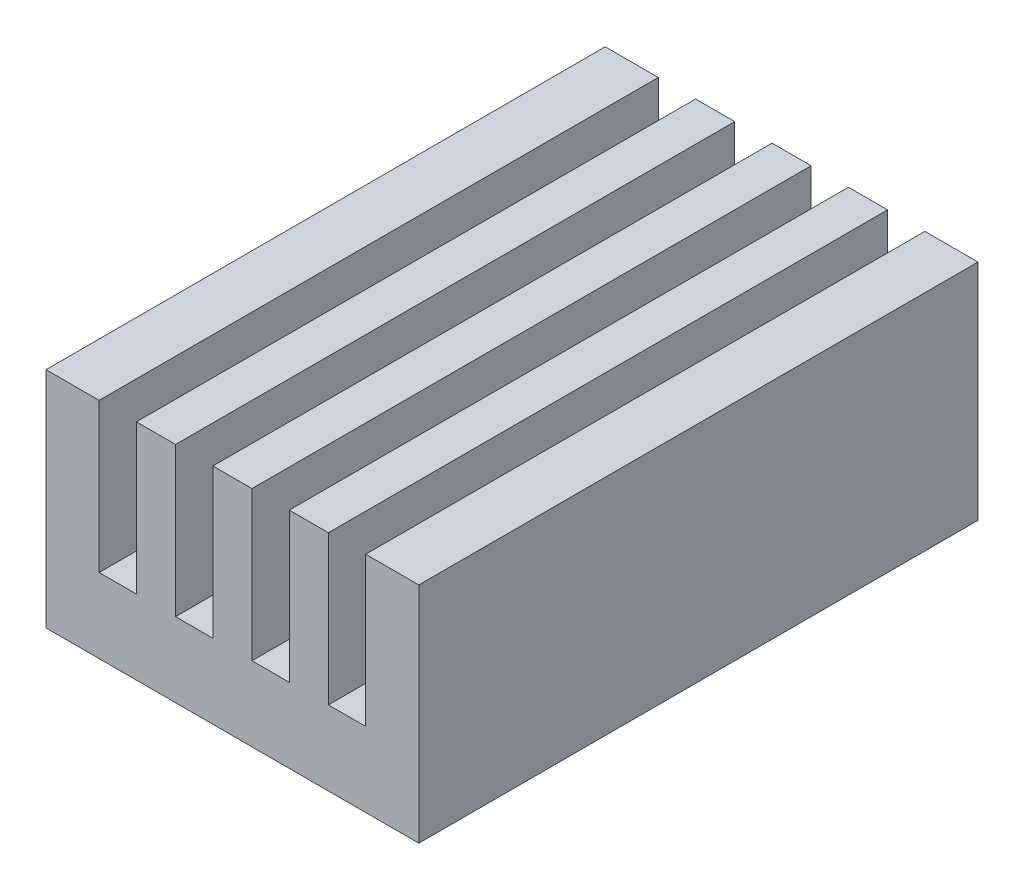
ISO-10303-21;
HEADER;
FILE_DESCRIPTION(('STEP AP214'),'2;1');
FILE_NAME('part.step','',(''),(''),'','','');
FILE_SCHEMA(('AUTOMOTIVE_DESIGN { 1 0 10303 214 1 1 1 1 }'));
ENDSEC;
DATA;
#1=APPLICATION_CONTEXT('core data for automotive mechanical design processes');
#2=APPLICATION_PROTOCOL_DEFINITION('international standard','automotive_design',2000,#1);
#3=PRODUCT_CONTEXT('',#1,'mechanical');
#4=PRODUCT('Part','Part','',(#3));
#5=PRODUCT_RELATED_PRODUCT_CATEGORY('part','',(#4));
#6=PRODUCT_DEFINITION_FORMATION('','',#4);
#7=PRODUCT_DEFINITION_CONTEXT('part definition',#1,'design');
#8=PRODUCT_DEFINITION('design','',#6,#7);
#9=PRODUCT_DEFINITION_SHAPE('','',#8);
#10=(LENGTH_UNIT() NAMED_UNIT(*) SI_UNIT(.MILLI.,.METRE.));
#11=(NAMED_UNIT(*) PLANE_ANGLE_UNIT() SI_UNIT($,.RADIAN.));
#12=(NAMED_UNIT(*) SI_UNIT($,.STERADIAN.) SOLID_ANGLE_UNIT());
#13=UNCERTAINTY_MEASURE_WITH_UNIT(LENGTH_MEASURE(1.E-05),#10,'distance_accuracy_value','');
#14=(GEOMETRIC_REPRESENTATION_CONTEXT(3) GLOBAL_UNCERTAINTY_ASSIGNED_CONTEXT((#13)) GLOBAL_UNIT_ASSIGNED_CONTEXT((#10,
#11,#12)) REPRESENTATION_CONTEXT('',''));
#15=CARTESIAN_POINT('',(0.,0.,0.));
#16=DIRECTION('',(0.,0.,1.));
#17=DIRECTION('',(1.,0.,0.));
#18=AXIS2_PLACEMENT_3D('',#15,#16,#17);
#19=CARTESIAN_POINT('',(-3.575,0.,15.));
#20=DIRECTION('',(1.,0.,0.));
#21=DIRECTION('',(0.,0.,-1.));
#22=AXIS2_PLACEMENT_3D('',#19,#20,#21);
#23=PLANE('',#22);
#24=DIRECTION('',(0.,-1.,0.));
#25=VECTOR('',#24,1.);
#26=CARTESIAN_POINT('',(-3.575,0.,0.));
#27=LINE('',#26,#25);
#28=CARTESIAN_POINT('',(-3.575,6.,0.));
#29=VERTEX_POINT('',#28);
#30=CARTESIAN_POINT('',(-3.575,2.,0.));
#31=VERTEX_POINT('',#30);
#32=EDGE_CURVE('E247',#29,#31,#27,.T.);
#33=ORIENTED_EDGE('',*,*,#32,.F.);
#34=DIRECTION('',(0.,0.,-1.));
#35=VECTOR('',#34,1.);
#36=CARTESIAN_POINT('',(-3.575,6.,15.));
#37=LINE('',#36,#35);
#38=CARTESIAN_POINT('',(-3.575,6.,15.));
#39=VERTEX_POINT('',#38);
#40=EDGE_CURVE('E11',#39,#29,#37,.T.);
#41=ORIENTED_EDGE('',*,*,#40,.F.);
#42=DIRECTION('',(0.,-1.,0.));
#43=VECTOR('',#42,1.);
#44=CARTESIAN_POINT('',(-3.575,0.,15.));
#45=LINE('',#44,#43);
#46=CARTESIAN_POINT('',(-3.575,2.,15.));
#47=VERTEX_POINT('',#46);
#48=EDGE_CURVE('E209',#39,#47,#45,.T.);
#49=ORIENTED_EDGE('',*,*,#48,.T.);
#50=DIRECTION('',(0.,0.,-1.));
#51=VECTOR('',#50,1.);
#52=CARTESIAN_POINT('',(-3.575,2.,15.));
#53=LINE('',#52,#51);
#54=EDGE_CURVE('E123',#47,#31,#53,.T.);
#55=ORIENTED_EDGE('',*,*,#54,.T.);
#56=EDGE_LOOP('',(#33,#41,#49,#55));
#57=FACE_BOUND('',#56,.T.);
#58=ADVANCED_FACE('F36',(#57),#23,.T.);
#59=CARTESIAN_POINT('',(0.,6.,15.));
#60=DIRECTION('',(0.,1.,0.));
#61=DIRECTION('',(-1.,0.,0.));
#62=AXIS2_PLACEMENT_3D('',#59,#60,#61);
#63=PLANE('',#62);
#64=DIRECTION('',(1.,0.,0.));
#65=VECTOR('',#64,1.);
#66=CARTESIAN_POINT('',(0.,6.,0.));
#67=LINE('',#66,#65);
#68=CARTESIAN_POINT('',(-5.,6.,0.));
#69=VERTEX_POINT('',#68);
#70=EDGE_CURVE('E250',#69,#29,#67,.T.);
#71=ORIENTED_EDGE('',*,*,#70,.F.);
#72=DIRECTION('',(0.,0.,-1.));
#73=VECTOR('',#72,1.);
#74=CARTESIAN_POINT('',(-5.,6.,15.));
#75=LINE('',#74,#73);
#76=CARTESIAN_POINT('',(-5.,6.,15.));
#77=VERTEX_POINT('',#76);
#78=EDGE_CURVE('E45',#77,#69,#75,.T.);
#79=ORIENTED_EDGE('',*,*,#78,.F.);
#80=DIRECTION('',(1.,0.,0.));
#81=VECTOR('',#80,1.);
#82=CARTESIAN_POINT('',(0.,6.,15.));
#83=LINE('',#82,#81);
#84=EDGE_CURVE('E198',#77,#39,#83,.T.);
#85=ORIENTED_EDGE('',*,*,#84,.T.);
#86=ORIENTED_EDGE('',*,*,#40,.T.);
#87=EDGE_LOOP('',(#71,#79,#85,#86));
#88=FACE_BOUND('',#87,.T.);
#89=ADVANCED_FACE('F337',(#88),#63,.T.);
#90=CARTESIAN_POINT('',(-5.,0.,15.));
#91=DIRECTION('',(1.,0.,0.));
#92=DIRECTION('',(0.,1.,0.));
#93=AXIS2_PLACEMENT_3D('',#90,#91,#92);
#94=PLANE('',#93);
#95=DIRECTION('',(0.,-1.,0.));
#96=VECTOR('',#95,1.);
#97=CARTESIAN_POINT('',(-5.,0.,0.));
#98=LINE('',#97,#96);
#99=CARTESIAN_POINT('',(-5.,0.,0.));
#100=VERTEX_POINT('',#99);
#101=EDGE_CURVE('E253',#69,#100,#98,.T.);
#102=ORIENTED_EDGE('',*,*,#101,.T.);
#103=DIRECTION('',(0.,0.,-1.));
#104=VECTOR('',#103,1.);
#105=CARTESIAN_POINT('',(-5.,0.,15.));
#106=LINE('',#105,#104);
#107=CARTESIAN_POINT('',(-5.,0.,15.));
#108=VERTEX_POINT('',#107);
#109=EDGE_CURVE('E326',#108,#100,#106,.T.);
#110=ORIENTED_EDGE('',*,*,#109,.F.);
#111=DIRECTION('',(0.,-1.,0.));
#112=VECTOR('',#111,1.);
#113=CARTESIAN_POINT('',(-5.,0.,15.));
#114=LINE('',#113,#112);
#115=EDGE_CURVE('E208',#77,#108,#114,.T.);
#116=ORIENTED_EDGE('',*,*,#115,.F.);
#117=ORIENTED_EDGE('',*,*,#78,.T.);
#118=EDGE_LOOP('',(#102,#110,#116,#117));
#119=FACE_BOUND('',#118,.T.);
#120=ADVANCED_FACE('F331',(#119),#94,.F.);
#121=CARTESIAN_POINT('',(0.,0.,15.));
#122=DIRECTION('',(0.,1.,0.));
#123=DIRECTION('',(-1.,0.,0.));
#124=AXIS2_PLACEMENT_3D('',#121,#122,#123);
#125=PLANE('',#124);
#126=DIRECTION('',(1.,0.,0.));
#127=VECTOR('',#126,1.);
#128=CARTESIAN_POINT('',(0.,0.,0.));
#129=LINE('',#128,#127);
#130=CARTESIAN_POINT('',(5.,0.,0.));
#131=VERTEX_POINT('',#130);
#132=EDGE_CURVE('E256',#100,#131,#129,.T.);
#133=ORIENTED_EDGE('',*,*,#132,.T.);
#134=DIRECTION('',(0.,0.,-1.));
#135=VECTOR('',#134,1.);
#136=CARTESIAN_POINT('',(5.,0.,15.));
#137=LINE('',#136,#135);
#138=CARTESIAN_POINT('',(5.,0.,15.));
#139=VERTEX_POINT('',#138);
#140=EDGE_CURVE('E324',#139,#131,#137,.T.);
#141=ORIENTED_EDGE('',*,*,#140,.F.);
#142=DIRECTION('',(1.,0.,0.));
#143=VECTOR('',#142,1.);
#144=CARTESIAN_POINT('',(0.,0.,15.));
#145=LINE('',#144,#143);
#146=EDGE_CURVE('E213',#108,#139,#145,.T.);
#147=ORIENTED_EDGE('',*,*,#146,.F.);
#148=ORIENTED_EDGE('',*,*,#109,.T.);
#149=EDGE_LOOP('',(#133,#141,#147,#148));
#150=FACE_BOUND('',#149,.T.);
#151=ADVANCED_FACE('F345',(#150),#125,.F.);
#152=CARTESIAN_POINT('',(5.,0.,15.));
#153=DIRECTION('',(1.,0.,0.));
#154=DIRECTION('',(0.,1.,0.));
#155=AXIS2_PLACEMENT_3D('',#152,#153,#154);
#156=PLANE('',#155);
#157=DIRECTION('',(0.,-1.,0.));
#158=VECTOR('',#157,1.);
#159=CARTESIAN_POINT('',(5.,0.,0.));
#160=LINE('',#159,#158);
#161=CARTESIAN_POINT('',(5.,6.,0.));
#162=VERTEX_POINT('',#161);
#163=EDGE_CURVE('E259',#162,#131,#160,.T.);
#164=ORIENTED_EDGE('',*,*,#163,.F.);
#165=DIRECTION('',(0.,0.,-1.));
#166=VECTOR('',#165,1.);
#167=CARTESIAN_POINT('',(5.,6.,15.));
#168=LINE('',#167,#166);
#169=CARTESIAN_POINT('',(5.,6.,15.));
#170=VERTEX_POINT('',#169);
#171=EDGE_CURVE('E322',#170,#162,#168,.T.);
#172=ORIENTED_EDGE('',*,*,#171,.F.);
#173=DIRECTION('',(0.,-1.,0.));
#174=VECTOR('',#173,1.);
#175=CARTESIAN_POINT('',(5.,0.,15.));
#176=LINE('',#175,#174);
#177=EDGE_CURVE('E217',#170,#139,#176,.T.);
#178=ORIENTED_EDGE('',*,*,#177,.T.);
#179=ORIENTED_EDGE('',*,*,#140,.T.);
#180=EDGE_LOOP('',(#164,#172,#178,#179));
#181=FACE_BOUND('',#180,.T.);
#182=ADVANCED_FACE('F369',(#181),#156,.T.);
#183=CARTESIAN_POINT('',(3.575,6.,0.));
#184=VERTEX_POINT('',#183);
#185=EDGE_CURVE('E254',#184,#162,#67,.T.);
#186=ORIENTED_EDGE('',*,*,#185,.F.);
#187=DIRECTION('',(0.,0.,-1.));
#188=VECTOR('',#187,1.);
#189=CARTESIAN_POINT('',(3.575,6.,15.));
#190=LINE('',#189,#188);
#191=CARTESIAN_POINT('',(3.575,6.,15.));
#192=VERTEX_POINT('',#191);
#193=EDGE_CURVE('E320',#192,#184,#190,.T.);
#194=ORIENTED_EDGE('',*,*,#193,.F.);
#195=EDGE_CURVE('E210',#192,#170,#83,.T.);
#196=ORIENTED_EDGE('',*,*,#195,.T.);
#197=ORIENTED_EDGE('',*,*,#171,.T.);
#198=EDGE_LOOP('',(#186,#194,#196,#197));
#199=FACE_BOUND('',#198,.T.);
#200=ADVANCED_FACE('F383',(#199),#63,.T.);
#201=CARTESIAN_POINT('',(3.575,0.,15.));
#202=DIRECTION('',(1.,0.,0.));
#203=DIRECTION('',(0.,0.,-1.));
#204=AXIS2_PLACEMENT_3D('',#201,#202,#203);
#205=PLANE('',#204);
#206=DIRECTION('',(0.,-1.,0.));
#207=VECTOR('',#206,1.);
#208=CARTESIAN_POINT('',(3.575,0.,0.));
#209=LINE('',#208,#207);
#210=CARTESIAN_POINT('',(3.575,2.,0.));
#211=VERTEX_POINT('',#210);
#212=EDGE_CURVE('E263',#184,#211,#209,.T.);
#213=ORIENTED_EDGE('',*,*,#212,.T.);
#214=DIRECTION('',(0.,0.,-1.));
#215=VECTOR('',#214,1.);
#216=CARTESIAN_POINT('',(3.575,2.,15.));
#217=LINE('',#216,#215);
#218=CARTESIAN_POINT('',(3.575,2.,15.));
#219=VERTEX_POINT('',#218);
#220=EDGE_CURVE('E317',#219,#211,#217,.T.);
#221=ORIENTED_EDGE('',*,*,#220,.F.);
#222=DIRECTION('',(0.,-1.,0.));
#223=VECTOR('',#222,1.);
#224=CARTESIAN_POINT('',(3.575,0.,15.));
#225=LINE('',#224,#223);
#226=EDGE_CURVE('E216',#192,#219,#225,.T.);
#227=ORIENTED_EDGE('',*,*,#226,.F.);
#228=ORIENTED_EDGE('',*,*,#193,.T.);
#229=EDGE_LOOP('',(#213,#221,#227,#228));
#230=FACE_BOUND('',#229,.T.);
#231=ADVANCED_FACE('F391',(#230),#205,.F.);
#232=CARTESIAN_POINT('',(0.,2.,15.));
#233=DIRECTION('',(0.,1.,0.));
#234=DIRECTION('',(0.,0.,1.));
#235=AXIS2_PLACEMENT_3D('',#232,#233,#234);
#236=PLANE('',#235);
#237=DIRECTION('',(1.,0.,0.));
#238=VECTOR('',#237,1.);
#239=CARTESIAN_POINT('',(0.,2.,0.));
#240=LINE('',#239,#238);
#241=CARTESIAN_POINT('',(2.575,2.,0.));
#242=VERTEX_POINT('',#241);
#243=EDGE_CURVE('E266',#242,#211,#240,.T.);
#244=ORIENTED_EDGE('',*,*,#243,.F.);
#245=DIRECTION('',(0.,0.,-1.));
#246=VECTOR('',#245,1.);
#247=CARTESIAN_POINT('',(2.575,2.,15.));
#248=LINE('',#247,#246);
#249=CARTESIAN_POINT('',(2.575,2.,15.));
#250=VERTEX_POINT('',#249);
#251=EDGE_CURVE('E315',#250,#242,#248,.T.);
#252=ORIENTED_EDGE('',*,*,#251,.F.);
#253=DIRECTION('',(1.,0.,0.));
#254=VECTOR('',#253,1.);
#255=CARTESIAN_POINT('',(0.,2.,15.));
#256=LINE('',#255,#254);
#257=EDGE_CURVE('E220',#250,#219,#256,.T.);
#258=ORIENTED_EDGE('',*,*,#257,.T.);
#259=ORIENTED_EDGE('',*,*,#220,.T.);
#260=EDGE_LOOP('',(#244,#252,#258,#259));
#261=FACE_BOUND('',#260,.T.);
#262=ADVANCED_FACE('F399',(#261),#236,.T.);
#263=CARTESIAN_POINT('',(2.575,0.,15.));
#264=DIRECTION('',(1.,0.,0.));
#265=DIRECTION('',(0.,0.,-1.));
#266=AXIS2_PLACEMENT_3D('',#263,#264,#265);
#267=PLANE('',#266);
#268=DIRECTION('',(0.,-1.,0.));
#269=VECTOR('',#268,1.);
#270=CARTESIAN_POINT('',(2.575,0.,0.));
#271=LINE('',#270,#269);
#272=CARTESIAN_POINT('',(2.575,6.,0.));
#273=VERTEX_POINT('',#272);
#274=EDGE_CURVE('E269',#273,#242,#271,.T.);
#275=ORIENTED_EDGE('',*,*,#274,.F.);
#276=DIRECTION('',(0.,0.,-1.));
#277=VECTOR('',#276,1.);
#278=CARTESIAN_POINT('',(2.575,6.,15.));
#279=LINE('',#278,#277);
#280=CARTESIAN_POINT('',(2.575,6.,15.));
#281=VERTEX_POINT('',#280);
#282=EDGE_CURVE('E313',#281,#273,#279,.T.);
#283=ORIENTED_EDGE('',*,*,#282,.F.);
#284=DIRECTION('',(0.,-1.,0.));
#285=VECTOR('',#284,1.);
#286=CARTESIAN_POINT('',(2.575,0.,15.));
#287=LINE('',#286,#285);
#288=EDGE_CURVE('E226',#281,#250,#287,.T.);
#289=ORIENTED_EDGE('',*,*,#288,.T.);
#290=ORIENTED_EDGE('',*,*,#251,.T.);
#291=EDGE_LOOP('',(#275,#283,#289,#290));
#292=FACE_BOUND('',#291,.T.);
#293=ADVANCED_FACE('F407',(#292),#267,.T.);
#294=CARTESIAN_POINT('',(1.525,6.,0.));
#295=VERTEX_POINT('',#294);
#296=EDGE_CURVE('E273',#295,#273,#67,.T.);
#297=ORIENTED_EDGE('',*,*,#296,.F.);
#298=DIRECTION('',(0.,0.,-1.));
#299=VECTOR('',#298,1.);
#300=CARTESIAN_POINT('',(1.525,6.,15.));
#301=LINE('',#300,#299);
#302=CARTESIAN_POINT('',(1.525,6.,15.));
#303=VERTEX_POINT('',#302);
#304=EDGE_CURVE('E311',#303,#295,#301,.T.);
#305=ORIENTED_EDGE('',*,*,#304,.F.);
#306=EDGE_CURVE('E206',#303,#281,#83,.T.);
#307=ORIENTED_EDGE('',*,*,#306,.T.);
#308=ORIENTED_EDGE('',*,*,#282,.T.);
#309=EDGE_LOOP('',(#297,#305,#307,#308));
#310=FACE_BOUND('',#309,.T.);
#311=ADVANCED_FACE('F393',(#310),#63,.T.);
#312=CARTESIAN_POINT('',(1.525,0.,15.));
#313=DIRECTION('',(1.,0.,0.));
#314=DIRECTION('',(0.,1.,0.));
#315=AXIS2_PLACEMENT_3D('',#312,#313,#314);
#316=PLANE('',#315);
#317=DIRECTION('',(0.,-1.,0.));
#318=VECTOR('',#317,1.);
#319=CARTESIAN_POINT('',(1.525,0.,0.));
#320=LINE('',#319,#318);
#321=CARTESIAN_POINT('',(1.525,2.,0.));
#322=VERTEX_POINT('',#321);
#323=EDGE_CURVE('E274',#295,#322,#320,.T.);
#324=ORIENTED_EDGE('',*,*,#323,.T.);
#325=DIRECTION('',(0.,0.,-1.));
#326=VECTOR('',#325,1.);
#327=CARTESIAN_POINT('',(1.525,2.,15.));
#328=LINE('',#327,#326);
#329=CARTESIAN_POINT('',(1.525,2.,15.));
#330=VERTEX_POINT('',#329);
#331=EDGE_CURVE('E308',#330,#322,#328,.T.);
#332=ORIENTED_EDGE('',*,*,#331,.F.);
#333=DIRECTION('',(0.,-1.,0.));
#334=VECTOR('',#333,1.);
#335=CARTESIAN_POINT('',(1.525,0.,15.));
#336=LINE('',#335,#334);
#337=EDGE_CURVE('E225',#303,#330,#336,.T.);
#338=ORIENTED_EDGE('',*,*,#337,.F.);
#339=ORIENTED_EDGE('',*,*,#304,.T.);
#340=EDGE_LOOP('',(#324,#332,#338,#339));
#341=FACE_BOUND('',#340,.T.);
#342=ADVANCED_FACE('F421',(#341),#316,.F.);
#343=CARTESIAN_POINT('',(0.,2.,15.));
#344=DIRECTION('',(0.,1.,0.));
#345=DIRECTION('',(0.,0.,1.));
#346=AXIS2_PLACEMENT_3D('',#343,#344,#345);
#347=PLANE('',#346);
#348=DIRECTION('',(1.,0.,0.));
#349=VECTOR('',#348,1.);
#350=CARTESIAN_POINT('',(0.,2.,0.));
#351=LINE('',#350,#349);
#352=CARTESIAN_POINT('',(0.525000000000001,2.,0.));
#353=VERTEX_POINT('',#352);
#354=EDGE_CURVE('E277',#353,#322,#351,.T.);
#355=ORIENTED_EDGE('',*,*,#354,.F.);
#356=DIRECTION('',(0.,0.,-1.));
#357=VECTOR('',#356,1.);
#358=CARTESIAN_POINT('',(0.525000000000001,2.,15.));
#359=LINE('',#358,#357);
#360=CARTESIAN_POINT('',(0.525000000000001,2.,15.));
#361=VERTEX_POINT('',#360);
#362=EDGE_CURVE('E306',#361,#353,#359,.T.);
#363=ORIENTED_EDGE('',*,*,#362,.F.);
#364=DIRECTION('',(1.,0.,0.));
#365=VECTOR('',#364,1.);
#366=CARTESIAN_POINT('',(0.,2.,15.));
#367=LINE('',#366,#365);
#368=EDGE_CURVE('E229',#361,#330,#367,.T.);
#369=ORIENTED_EDGE('',*,*,#368,.T.);
#370=ORIENTED_EDGE('',*,*,#331,.T.);
#371=EDGE_LOOP('',(#355,#363,#369,#370));
#372=FACE_BOUND('',#371,.T.);
#373=ADVANCED_FACE('F428',(#372),#347,.T.);
#374=CARTESIAN_POINT('',(0.525000000000001,0.,15.));
#375=DIRECTION('',(1.,0.,0.));
#376=DIRECTION('',(0.,0.,-1.));
#377=AXIS2_PLACEMENT_3D('',#374,#375,#376);
#378=PLANE('',#377);
#379=DIRECTION('',(0.,-1.,0.));
#380=VECTOR('',#379,1.);
#381=CARTESIAN_POINT('',(0.525000000000001,0.,0.));
#382=LINE('',#381,#380);
#383=CARTESIAN_POINT('',(0.525000000000001,6.,0.));
#384=VERTEX_POINT('',#383);
#385=EDGE_CURVE('E280',#384,#353,#382,.T.);
#386=ORIENTED_EDGE('',*,*,#385,.F.);
#387=DIRECTION('',(0.,0.,-1.));
#388=VECTOR('',#387,1.);
#389=CARTESIAN_POINT('',(0.525000000000001,6.,15.));
#390=LINE('',#389,#388);
#391=CARTESIAN_POINT('',(0.525000000000001,6.,15.));
#392=VERTEX_POINT('',#391);
#393=EDGE_CURVE('E304',#392,#384,#390,.T.);
#394=ORIENTED_EDGE('',*,*,#393,.F.);
#395=DIRECTION('',(0.,-1.,0.));
#396=VECTOR('',#395,1.);
#397=CARTESIAN_POINT('',(0.525000000000001,0.,15.));
#398=LINE('',#397,#396);
#399=EDGE_CURVE('E205',#392,#361,#398,.T.);
#400=ORIENTED_EDGE('',*,*,#399,.T.);
#401=ORIENTED_EDGE('',*,*,#362,.T.);
#402=EDGE_LOOP('',(#386,#394,#400,#401));
#403=FACE_BOUND('',#402,.T.);
#404=ADVANCED_FACE('F436',(#403),#378,.T.);
#405=CARTESIAN_POINT('',(-0.525,6.,0.));
#406=VERTEX_POINT('',#405);
#407=EDGE_CURVE('E283',#406,#384,#67,.T.);
#408=ORIENTED_EDGE('',*,*,#407,.F.);
#409=DIRECTION('',(0.,0.,-1.));
#410=VECTOR('',#409,1.);
#411=CARTESIAN_POINT('',(-0.525,6.,15.));
#412=LINE('',#411,#410);
#413=CARTESIAN_POINT('',(-0.525,6.,15.));
#414=VERTEX_POINT('',#413);
#415=EDGE_CURVE('E302',#414,#406,#412,.T.);
#416=ORIENTED_EDGE('',*,*,#415,.F.);
#417=EDGE_CURVE('E197',#414,#392,#83,.T.);
#418=ORIENTED_EDGE('',*,*,#417,.T.);
#419=ORIENTED_EDGE('',*,*,#393,.T.);
#420=EDGE_LOOP('',(#408,#416,#418,#419));
#421=FACE_BOUND('',#420,.T.);
#422=ADVANCED_FACE('F422',(#421),#63,.T.);
#423=CARTESIAN_POINT('',(-0.525,0.,15.));
#424=DIRECTION('',(1.,0.,0.));
#425=DIRECTION('',(0.,0.,-1.));
#426=AXIS2_PLACEMENT_3D('',#423,#424,#425);
#427=PLANE('',#426);
#428=DIRECTION('',(0.,-1.,0.));
#429=VECTOR('',#428,1.);
#430=CARTESIAN_POINT('',(-0.525,0.,0.));
#431=LINE('',#430,#429);
#432=CARTESIAN_POINT('',(-0.525,2.,0.));
#433=VERTEX_POINT('',#432);
#434=EDGE_CURVE('E284',#406,#433,#431,.T.);
#435=ORIENTED_EDGE('',*,*,#434,.T.);
#436=DIRECTION('',(0.,0.,-1.));
#437=VECTOR('',#436,1.);
#438=CARTESIAN_POINT('',(-0.525,2.,15.));
#439=LINE('',#438,#437);
#440=CARTESIAN_POINT('',(-0.525,2.,15.));
#441=VERTEX_POINT('',#440);
#442=EDGE_CURVE('E299',#441,#433,#439,.T.);
#443=ORIENTED_EDGE('',*,*,#442,.F.);
#444=DIRECTION('',(0.,-1.,0.));
#445=VECTOR('',#444,1.);
#446=CARTESIAN_POINT('',(-0.525,0.,15.));
#447=LINE('',#446,#445);
#448=EDGE_CURVE('E204',#414,#441,#447,.T.);
#449=ORIENTED_EDGE('',*,*,#448,.F.);
#450=ORIENTED_EDGE('',*,*,#415,.T.);
#451=EDGE_LOOP('',(#435,#443,#449,#450));
#452=FACE_BOUND('',#451,.T.);
#453=ADVANCED_FACE('F451',(#452),#427,.F.);
#454=CARTESIAN_POINT('',(0.,2.,15.));
#455=DIRECTION('',(0.,-1.,0.));
#456=DIRECTION('',(1.,0.,0.));
#457=AXIS2_PLACEMENT_3D('',#454,#455,#456);
#458=PLANE('',#457);
#459=DIRECTION('',(-1.,0.,0.));
#460=VECTOR('',#459,1.);
#461=CARTESIAN_POINT('',(0.,2.,0.));
#462=LINE('',#461,#460);
#463=CARTESIAN_POINT('',(-1.525,2.,0.));
#464=VERTEX_POINT('',#463);
#465=EDGE_CURVE('E286',#433,#464,#462,.T.);
#466=ORIENTED_EDGE('',*,*,#465,.T.);
#467=DIRECTION('',(0.,0.,-1.));
#468=VECTOR('',#467,1.);
#469=CARTESIAN_POINT('',(-1.525,2.,15.));
#470=LINE('',#469,#468);
#471=CARTESIAN_POINT('',(-1.525,2.,15.));
#472=VERTEX_POINT('',#471);
#473=EDGE_CURVE('E297',#472,#464,#470,.T.);
#474=ORIENTED_EDGE('',*,*,#473,.F.);
#475=DIRECTION('',(-1.,0.,0.));
#476=VECTOR('',#475,1.);
#477=CARTESIAN_POINT('',(0.,2.,15.));
#478=LINE('',#477,#476);
#479=EDGE_CURVE('E199',#441,#472,#478,.T.);
#480=ORIENTED_EDGE('',*,*,#479,.F.);
#481=ORIENTED_EDGE('',*,*,#442,.T.);
#482=EDGE_LOOP('',(#466,#474,#480,#481));
#483=FACE_BOUND('',#482,.T.);
#484=ADVANCED_FACE('F458',(#483),#458,.F.);
#485=CARTESIAN_POINT('',(-1.525,0.,15.));
#486=DIRECTION('',(1.,0.,0.));
#487=DIRECTION('',(0.,1.,0.));
#488=AXIS2_PLACEMENT_3D('',#485,#486,#487);
#489=PLANE('',#488);
#490=DIRECTION('',(0.,-1.,0.));
#491=VECTOR('',#490,1.);
#492=CARTESIAN_POINT('',(-1.525,0.,0.));
#493=LINE('',#492,#491);
#494=CARTESIAN_POINT('',(-1.525,6.,0.));
#495=VERTEX_POINT('',#494);
#496=EDGE_CURVE('E289',#495,#464,#493,.T.);
#497=ORIENTED_EDGE('',*,*,#496,.F.);
#498=DIRECTION('',(0.,0.,-1.));
#499=VECTOR('',#498,1.);
#500=CARTESIAN_POINT('',(-1.525,6.,15.));
#501=LINE('',#500,#499);
#502=CARTESIAN_POINT('',(-1.525,6.,15.));
#503=VERTEX_POINT('',#502);
#504=EDGE_CURVE('E186',#503,#495,#501,.T.);
#505=ORIENTED_EDGE('',*,*,#504,.F.);
#506=DIRECTION('',(0.,-1.,0.));
#507=VECTOR('',#506,1.);
#508=CARTESIAN_POINT('',(-1.525,0.,15.));
#509=LINE('',#508,#507);
#510=EDGE_CURVE('E195',#503,#472,#509,.T.);
#511=ORIENTED_EDGE('',*,*,#510,.T.);
#512=ORIENTED_EDGE('',*,*,#473,.T.);
#513=EDGE_LOOP('',(#497,#505,#511,#512));
#514=FACE_BOUND('',#513,.T.);
#515=ADVANCED_FACE('F466',(#514),#489,.T.);
#516=CARTESIAN_POINT('',(-2.575,6.,0.));
#517=VERTEX_POINT('',#516);
#518=EDGE_CURVE('E185',#517,#495,#67,.T.);
#519=ORIENTED_EDGE('',*,*,#518,.F.);
#520=DIRECTION('',(0.,0.,-1.));
#521=VECTOR('',#520,1.);
#522=CARTESIAN_POINT('',(-2.575,6.,15.));
#523=LINE('',#522,#521);
#524=CARTESIAN_POINT('',(-2.575,6.,15.));
#525=VERTEX_POINT('',#524);
#526=EDGE_CURVE('E179',#525,#517,#523,.T.);
#527=ORIENTED_EDGE('',*,*,#526,.F.);
#528=EDGE_CURVE('E183',#525,#503,#83,.T.);
#529=ORIENTED_EDGE('',*,*,#528,.T.);
#530=ORIENTED_EDGE('',*,*,#504,.T.);
#531=EDGE_LOOP('',(#519,#527,#529,#530));
#532=FACE_BOUND('',#531,.T.);
#533=ADVANCED_FACE('F181',(#532),#63,.T.);
#534=CARTESIAN_POINT('',(-2.575,0.,15.));
#535=DIRECTION('',(1.,0.,0.));
#536=DIRECTION('',(0.,0.,-1.));
#537=AXIS2_PLACEMENT_3D('',#534,#535,#536);
#538=PLANE('',#537);
#539=DIRECTION('',(0.,-1.,0.));
#540=VECTOR('',#539,1.);
#541=CARTESIAN_POINT('',(-2.575,0.,0.));
#542=LINE('',#541,#540);
#543=CARTESIAN_POINT('',(-2.575,2.,0.));
#544=VERTEX_POINT('',#543);
#545=EDGE_CURVE('E116',#517,#544,#542,.T.);
#546=ORIENTED_EDGE('',*,*,#545,.T.);
#547=DIRECTION('',(0.,0.,-1.));
#548=VECTOR('',#547,1.);
#549=CARTESIAN_POINT('',(-2.575,2.,15.));
#550=LINE('',#549,#548);
#551=CARTESIAN_POINT('',(-2.575,2.,15.));
#552=VERTEX_POINT('',#551);
#553=EDGE_CURVE('E187',#552,#544,#550,.T.);
#554=ORIENTED_EDGE('',*,*,#553,.F.);
#555=DIRECTION('',(0.,-1.,0.));
#556=VECTOR('',#555,1.);
#557=CARTESIAN_POINT('',(-2.575,0.,15.));
#558=LINE('',#557,#556);
#559=EDGE_CURVE('E189',#525,#552,#558,.T.);
#560=ORIENTED_EDGE('',*,*,#559,.F.);
#561=ORIENTED_EDGE('',*,*,#526,.T.);
#562=EDGE_LOOP('',(#546,#554,#560,#561));
#563=FACE_BOUND('',#562,.T.);
#564=ADVANCED_FACE('F190',(#563),#538,.F.);
#565=CARTESIAN_POINT('',(0.,2.,15.));
#566=DIRECTION('',(0.,-1.,0.));
#567=DIRECTION('',(1.,0.,0.));
#568=AXIS2_PLACEMENT_3D('',#565,#566,#567);
#569=PLANE('',#568);
#570=DIRECTION('',(-1.,0.,0.));
#571=VECTOR('',#570,1.);
#572=CARTESIAN_POINT('',(0.,2.,0.));
#573=LINE('',#572,#571);
#574=EDGE_CURVE('E214',#544,#31,#573,.T.);
#575=ORIENTED_EDGE('',*,*,#574,.T.);
#576=ORIENTED_EDGE('',*,*,#54,.F.);
#577=DIRECTION('',(-1.,0.,0.));
#578=VECTOR('',#577,1.);
#579=CARTESIAN_POINT('',(0.,2.,15.));
#580=LINE('',#579,#578);
#581=EDGE_CURVE('E53',#552,#47,#580,.T.);
#582=ORIENTED_EDGE('',*,*,#581,.F.);
#583=ORIENTED_EDGE('',*,*,#553,.T.);
#584=EDGE_LOOP('',(#575,#576,#582,#583));
#585=FACE_BOUND('',#584,.T.);
#586=ADVANCED_FACE('F340',(#585),#569,.F.);
#587=CARTESIAN_POINT('',(0.,0.,15.));
#588=DIRECTION('',(0.,0.,1.));
#589=DIRECTION('',(1.,0.,0.));
#590=AXIS2_PLACEMENT_3D('',#587,#588,#589);
#591=PLANE('',#590);
#592=ORIENTED_EDGE('',*,*,#48,.F.);
#593=ORIENTED_EDGE('',*,*,#84,.F.);
#594=ORIENTED_EDGE('',*,*,#115,.T.);
#595=ORIENTED_EDGE('',*,*,#146,.T.);
#596=ORIENTED_EDGE('',*,*,#177,.F.);
#597=ORIENTED_EDGE('',*,*,#195,.F.);
#598=ORIENTED_EDGE('',*,*,#226,.T.);
#599=ORIENTED_EDGE('',*,*,#257,.F.);
#600=ORIENTED_EDGE('',*,*,#288,.F.);
#601=ORIENTED_EDGE('',*,*,#306,.F.);
#602=ORIENTED_EDGE('',*,*,#337,.T.);
#603=ORIENTED_EDGE('',*,*,#368,.F.);
#604=ORIENTED_EDGE('',*,*,#399,.F.);
#605=ORIENTED_EDGE('',*,*,#417,.F.);
#606=ORIENTED_EDGE('',*,*,#448,.T.);
#607=ORIENTED_EDGE('',*,*,#479,.T.);
#608=ORIENTED_EDGE('',*,*,#510,.F.);
#609=ORIENTED_EDGE('',*,*,#528,.F.);
#610=ORIENTED_EDGE('',*,*,#559,.T.);
#611=ORIENTED_EDGE('',*,*,#581,.T.);
#612=EDGE_LOOP('',(#592,#593,#594,#595,#596,#597,#598,#599,#600,#601,#602,#603,#604,#605,#606,
#607,#608,#609,#610,#611));
#613=FACE_BOUND('',#612,.T.);
#614=ADVANCED_FACE('F193',(#613),#591,.T.);
#615=CARTESIAN_POINT('',(0.,0.,0.));
#616=DIRECTION('',(0.,0.,1.));
#617=DIRECTION('',(1.,0.,0.));
#618=AXIS2_PLACEMENT_3D('',#615,#616,#617);
#619=PLANE('',#618);
#620=ORIENTED_EDGE('',*,*,#32,.T.);
#621=ORIENTED_EDGE('',*,*,#574,.F.);
#622=ORIENTED_EDGE('',*,*,#545,.F.);
#623=ORIENTED_EDGE('',*,*,#518,.T.);
#624=ORIENTED_EDGE('',*,*,#496,.T.);
#625=ORIENTED_EDGE('',*,*,#465,.F.);
#626=ORIENTED_EDGE('',*,*,#434,.F.);
#627=ORIENTED_EDGE('',*,*,#407,.T.);
#628=ORIENTED_EDGE('',*,*,#385,.T.);
#629=ORIENTED_EDGE('',*,*,#354,.T.);
#630=ORIENTED_EDGE('',*,*,#323,.F.);
#631=ORIENTED_EDGE('',*,*,#296,.T.);
#632=ORIENTED_EDGE('',*,*,#274,.T.);
#633=ORIENTED_EDGE('',*,*,#243,.T.);
#634=ORIENTED_EDGE('',*,*,#212,.F.);
#635=ORIENTED_EDGE('',*,*,#185,.T.);
#636=ORIENTED_EDGE('',*,*,#163,.T.);
#637=ORIENTED_EDGE('',*,*,#132,.F.);
#638=ORIENTED_EDGE('',*,*,#101,.F.);
#639=ORIENTED_EDGE('',*,*,#70,.T.);
#640=EDGE_LOOP('',(#620,#621,#622,#623,#624,#625,#626,#627,#628,#629,#630,#631,#632,#633,#634,
#635,#636,#637,#638,#639));
#641=FACE_BOUND('',#640,.T.);
#642=ADVANCED_FACE('F336',(#641),#619,.F.);
#643=CLOSED_SHELL('',(#58,#89,#120,#151,#182,#200,#231,#262,#293,#311,#342,#373,#404,#422,#453,
#484,#515,#533,#564,#586,#614,#642));
#644=MANIFOLD_SOLID_BREP('B2',#643);
#645=ADVANCED_BREP_SHAPE_REPRESENTATION('',(#18,#644),#14);
#646=SHAPE_DEFINITION_REPRESENTATION(#9,#645);
ENDSEC;
END-ISO-10303-21;
